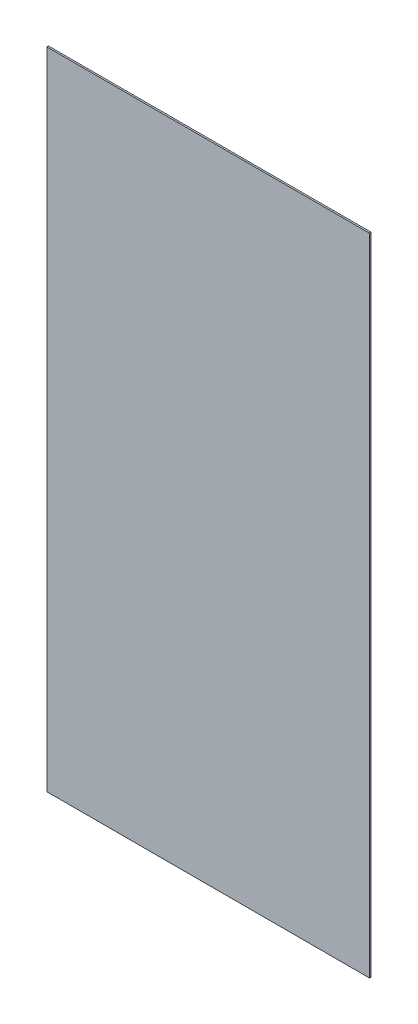
ISO-10303-21;
HEADER;
FILE_DESCRIPTION(('STEP AP214'),'2;1');
FILE_NAME('part.step','',(''),(''),'','','');
FILE_SCHEMA(('AUTOMOTIVE_DESIGN { 1 0 10303 214 1 1 1 1 }'));
ENDSEC;
DATA;
#1=APPLICATION_CONTEXT('core data for automotive mechanical design processes');
#2=APPLICATION_PROTOCOL_DEFINITION('international standard','automotive_design',2000,#1);
#3=PRODUCT_CONTEXT('',#1,'mechanical');
#4=PRODUCT('Part','Part','',(#3));
#5=PRODUCT_RELATED_PRODUCT_CATEGORY('part','',(#4));
#6=PRODUCT_DEFINITION_FORMATION('','',#4);
#7=PRODUCT_DEFINITION_CONTEXT('part definition',#1,'design');
#8=PRODUCT_DEFINITION('design','',#6,#7);
#9=PRODUCT_DEFINITION_SHAPE('','',#8);
#10=(LENGTH_UNIT() NAMED_UNIT(*) SI_UNIT(.MILLI.,.METRE.));
#11=(NAMED_UNIT(*) PLANE_ANGLE_UNIT() SI_UNIT($,.RADIAN.));
#12=(NAMED_UNIT(*) SI_UNIT($,.STERADIAN.) SOLID_ANGLE_UNIT());
#13=UNCERTAINTY_MEASURE_WITH_UNIT(LENGTH_MEASURE(1.E-05),#10,'distance_accuracy_value','');
#14=(GEOMETRIC_REPRESENTATION_CONTEXT(3) GLOBAL_UNCERTAINTY_ASSIGNED_CONTEXT((#13)) GLOBAL_UNIT_ASSIGNED_CONTEXT((#10,
#11,#12)) REPRESENTATION_CONTEXT('',''));
#15=CARTESIAN_POINT('',(0.,0.,0.));
#16=DIRECTION('',(0.,0.,1.));
#17=DIRECTION('',(1.,0.,0.));
#18=AXIS2_PLACEMENT_3D('',#15,#16,#17);
#19=CARTESIAN_POINT('',(15.,30.,0.15));
#20=DIRECTION('',(-1.,0.,0.));
#21=DIRECTION('',(0.,-1.,0.));
#22=AXIS2_PLACEMENT_3D('',#19,#20,#21);
#23=PLANE('',#22);
#24=DIRECTION('',(0.,1.,0.));
#25=VECTOR('',#24,1.);
#26=CARTESIAN_POINT('',(15.,30.,0.));
#27=LINE('',#26,#25);
#28=CARTESIAN_POINT('',(15.,-30.,0.));
#29=VERTEX_POINT('',#28);
#30=CARTESIAN_POINT('',(15.,30.,0.));
#31=VERTEX_POINT('',#30);
#32=EDGE_CURVE('E111',#29,#31,#27,.T.);
#33=ORIENTED_EDGE('',*,*,#32,.T.);
#34=DIRECTION('',(0.,0.,-1.));
#35=VECTOR('',#34,1.);
#36=CARTESIAN_POINT('',(15.,30.,0.15));
#37=LINE('',#36,#35);
#38=CARTESIAN_POINT('',(15.,30.,0.15));
#39=VERTEX_POINT('',#38);
#40=EDGE_CURVE('E11',#39,#31,#37,.T.);
#41=ORIENTED_EDGE('',*,*,#40,.F.);
#42=DIRECTION('',(0.,1.,0.));
#43=VECTOR('',#42,1.);
#44=CARTESIAN_POINT('',(15.,30.,0.15));
#45=LINE('',#44,#43);
#46=CARTESIAN_POINT('',(15.,-30.,0.15));
#47=VERTEX_POINT('',#46);
#48=EDGE_CURVE('E95',#47,#39,#45,.T.);
#49=ORIENTED_EDGE('',*,*,#48,.F.);
#50=DIRECTION('',(0.,0.,-1.));
#51=VECTOR('',#50,1.);
#52=CARTESIAN_POINT('',(15.,-30.,0.15));
#53=LINE('',#52,#51);
#54=EDGE_CURVE('E107',#47,#29,#53,.T.);
#55=ORIENTED_EDGE('',*,*,#54,.T.);
#56=EDGE_LOOP('',(#33,#41,#49,#55));
#57=FACE_BOUND('',#56,.T.);
#58=ADVANCED_FACE('F43',(#57),#23,.F.);
#59=CARTESIAN_POINT('',(-15.,30.,0.15));
#60=DIRECTION('',(0.,-1.,0.));
#61=DIRECTION('',(0.,0.,-1.));
#62=AXIS2_PLACEMENT_3D('',#59,#60,#61);
#63=PLANE('',#62);
#64=DIRECTION('',(-1.,0.,0.));
#65=VECTOR('',#64,1.);
#66=CARTESIAN_POINT('',(-15.,30.,0.));
#67=LINE('',#66,#65);
#68=CARTESIAN_POINT('',(-15.,30.,0.));
#69=VERTEX_POINT('',#68);
#70=EDGE_CURVE('E100',#31,#69,#67,.T.);
#71=ORIENTED_EDGE('',*,*,#70,.T.);
#72=DIRECTION('',(0.,0.,-1.));
#73=VECTOR('',#72,1.);
#74=CARTESIAN_POINT('',(-15.,30.,0.15));
#75=LINE('',#74,#73);
#76=CARTESIAN_POINT('',(-15.,30.,0.15));
#77=VERTEX_POINT('',#76);
#78=EDGE_CURVE('E52',#77,#69,#75,.T.);
#79=ORIENTED_EDGE('',*,*,#78,.F.);
#80=DIRECTION('',(-1.,0.,0.));
#81=VECTOR('',#80,1.);
#82=CARTESIAN_POINT('',(-15.,30.,0.15));
#83=LINE('',#82,#81);
#84=EDGE_CURVE('E90',#39,#77,#83,.T.);
#85=ORIENTED_EDGE('',*,*,#84,.F.);
#86=ORIENTED_EDGE('',*,*,#40,.T.);
#87=EDGE_LOOP('',(#71,#79,#85,#86));
#88=FACE_BOUND('',#87,.T.);
#89=ADVANCED_FACE('F99',(#88),#63,.F.);
#90=CARTESIAN_POINT('',(-15.,30.,0.15));
#91=DIRECTION('',(1.,0.,0.));
#92=DIRECTION('',(0.,1.,0.));
#93=AXIS2_PLACEMENT_3D('',#90,#91,#92);
#94=PLANE('',#93);
#95=DIRECTION('',(0.,-1.,0.));
#96=VECTOR('',#95,1.);
#97=CARTESIAN_POINT('',(-15.,30.,0.));
#98=LINE('',#97,#96);
#99=CARTESIAN_POINT('',(-15.,-30.,0.));
#100=VERTEX_POINT('',#99);
#101=EDGE_CURVE('E77',#69,#100,#98,.T.);
#102=ORIENTED_EDGE('',*,*,#101,.T.);
#103=DIRECTION('',(0.,0.,-1.));
#104=VECTOR('',#103,1.);
#105=CARTESIAN_POINT('',(-15.,-30.,0.15));
#106=LINE('',#105,#104);
#107=CARTESIAN_POINT('',(-15.,-30.,0.15));
#108=VERTEX_POINT('',#107);
#109=EDGE_CURVE('E102',#108,#100,#106,.T.);
#110=ORIENTED_EDGE('',*,*,#109,.F.);
#111=DIRECTION('',(0.,-1.,0.));
#112=VECTOR('',#111,1.);
#113=CARTESIAN_POINT('',(-15.,30.,0.15));
#114=LINE('',#113,#112);
#115=EDGE_CURVE('E93',#77,#108,#114,.T.);
#116=ORIENTED_EDGE('',*,*,#115,.F.);
#117=ORIENTED_EDGE('',*,*,#78,.T.);
#118=EDGE_LOOP('',(#102,#110,#116,#117));
#119=FACE_BOUND('',#118,.T.);
#120=ADVANCED_FACE('F103',(#119),#94,.F.);
#121=CARTESIAN_POINT('',(-15.,-30.,0.15));
#122=DIRECTION('',(0.,1.,0.));
#123=DIRECTION('',(0.,0.,1.));
#124=AXIS2_PLACEMENT_3D('',#121,#122,#123);
#125=PLANE('',#124);
#126=DIRECTION('',(1.,0.,0.));
#127=VECTOR('',#126,1.);
#128=CARTESIAN_POINT('',(-15.,-30.,0.));
#129=LINE('',#128,#127);
#130=EDGE_CURVE('E83',#100,#29,#129,.T.);
#131=ORIENTED_EDGE('',*,*,#130,.T.);
#132=ORIENTED_EDGE('',*,*,#54,.F.);
#133=DIRECTION('',(1.,0.,0.));
#134=VECTOR('',#133,1.);
#135=CARTESIAN_POINT('',(-15.,-30.,0.15));
#136=LINE('',#135,#134);
#137=EDGE_CURVE('E60',#108,#47,#136,.T.);
#138=ORIENTED_EDGE('',*,*,#137,.F.);
#139=ORIENTED_EDGE('',*,*,#109,.T.);
#140=EDGE_LOOP('',(#131,#132,#138,#139));
#141=FACE_BOUND('',#140,.T.);
#142=ADVANCED_FACE('F124',(#141),#125,.F.);
#143=CARTESIAN_POINT('',(0.,0.,0.15));
#144=DIRECTION('',(0.,0.,1.));
#145=DIRECTION('',(1.,0.,0.));
#146=AXIS2_PLACEMENT_3D('',#143,#144,#145);
#147=PLANE('',#146);
#148=ORIENTED_EDGE('',*,*,#48,.T.);
#149=ORIENTED_EDGE('',*,*,#84,.T.);
#150=ORIENTED_EDGE('',*,*,#115,.T.);
#151=ORIENTED_EDGE('',*,*,#137,.T.);
#152=EDGE_LOOP('',(#148,#149,#150,#151));
#153=FACE_BOUND('',#152,.T.);
#154=ADVANCED_FACE('F91',(#153),#147,.T.);
#155=CARTESIAN_POINT('',(0.,0.,0.));
#156=DIRECTION('',(0.,0.,1.));
#157=DIRECTION('',(1.,0.,0.));
#158=AXIS2_PLACEMENT_3D('',#155,#156,#157);
#159=PLANE('',#158);
#160=ORIENTED_EDGE('',*,*,#32,.F.);
#161=ORIENTED_EDGE('',*,*,#130,.F.);
#162=ORIENTED_EDGE('',*,*,#101,.F.);
#163=ORIENTED_EDGE('',*,*,#70,.F.);
#164=EDGE_LOOP('',(#160,#161,#162,#163));
#165=FACE_BOUND('',#164,.T.);
#166=ADVANCED_FACE('F127',(#165),#159,.F.);
#167=CLOSED_SHELL('',(#58,#89,#120,#142,#154,#166));
#168=MANIFOLD_SOLID_BREP('B2',#167);
#169=ADVANCED_BREP_SHAPE_REPRESENTATION('',(#18,#168),#14);
#170=SHAPE_DEFINITION_REPRESENTATION(#9,#169);
ENDSEC;
END-ISO-10303-21;
